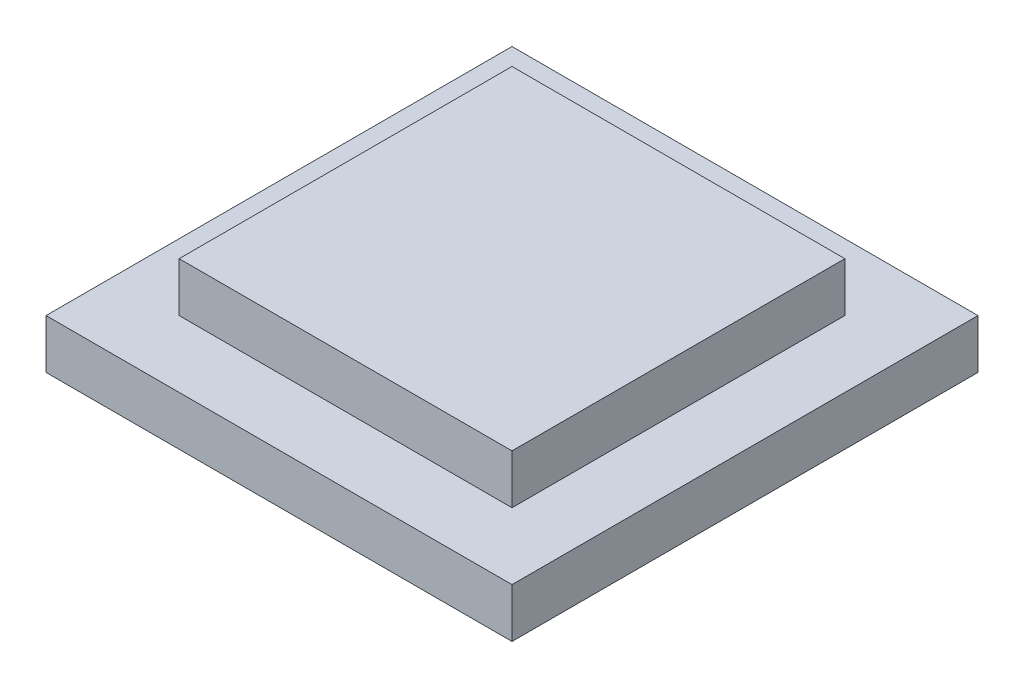
ISO-10303-21;
HEADER;
FILE_DESCRIPTION(('STEP AP214'),'2;1');
FILE_NAME('part.step','',(''),(''),'','','');
FILE_SCHEMA(('AUTOMOTIVE_DESIGN { 1 0 10303 214 1 1 1 1 }'));
ENDSEC;
DATA;
#1=APPLICATION_CONTEXT('core data for automotive mechanical design processes');
#2=APPLICATION_PROTOCOL_DEFINITION('international standard','automotive_design',2000,#1);
#3=PRODUCT_CONTEXT('',#1,'mechanical');
#4=PRODUCT('Part','Part','',(#3));
#5=PRODUCT_RELATED_PRODUCT_CATEGORY('part','',(#4));
#6=PRODUCT_DEFINITION_FORMATION('','',#4);
#7=PRODUCT_DEFINITION_CONTEXT('part definition',#1,'design');
#8=PRODUCT_DEFINITION('design','',#6,#7);
#9=PRODUCT_DEFINITION_SHAPE('','',#8);
#10=(LENGTH_UNIT() NAMED_UNIT(*) SI_UNIT(.MILLI.,.METRE.));
#11=(NAMED_UNIT(*) PLANE_ANGLE_UNIT() SI_UNIT($,.RADIAN.));
#12=(NAMED_UNIT(*) SI_UNIT($,.STERADIAN.) SOLID_ANGLE_UNIT());
#13=UNCERTAINTY_MEASURE_WITH_UNIT(LENGTH_MEASURE(1.E-05),#10,'distance_accuracy_value','');
#14=(GEOMETRIC_REPRESENTATION_CONTEXT(3) GLOBAL_UNCERTAINTY_ASSIGNED_CONTEXT((#13)) GLOBAL_UNIT_ASSIGNED_CONTEXT((#10,
#11,#12)) REPRESENTATION_CONTEXT('',''));
#15=CARTESIAN_POINT('',(0.,0.,0.));
#16=DIRECTION('',(0.,0.,1.));
#17=DIRECTION('',(1.,0.,0.));
#18=AXIS2_PLACEMENT_3D('',#15,#16,#17);
#19=CARTESIAN_POINT('',(0.,3.7,0.));
#20=DIRECTION('',(0.,-1.,0.));
#21=DIRECTION('',(0.,0.,-1.));
#22=AXIS2_PLACEMENT_3D('',#19,#20,#21);
#23=PLANE('',#22);
#24=DIRECTION('',(0.,0.,-1.));
#25=VECTOR('',#24,1.);
#26=CARTESIAN_POINT('',(17.5,3.7,17.5));
#27=LINE('',#26,#25);
#28=CARTESIAN_POINT('',(17.5,3.7,17.5));
#29=VERTEX_POINT('',#28);
#30=CARTESIAN_POINT('',(17.5,3.7,-17.5));
#31=VERTEX_POINT('',#30);
#32=EDGE_CURVE('E139',#29,#31,#27,.T.);
#33=ORIENTED_EDGE('',*,*,#32,.T.);
#34=DIRECTION('',(-1.,0.,0.));
#35=VECTOR('',#34,1.);
#36=CARTESIAN_POINT('',(-17.5,3.7,-17.5));
#37=LINE('',#36,#35);
#38=CARTESIAN_POINT('',(-17.5,3.7,-17.5));
#39=VERTEX_POINT('',#38);
#40=EDGE_CURVE('E143',#31,#39,#37,.T.);
#41=ORIENTED_EDGE('',*,*,#40,.T.);
#42=DIRECTION('',(0.,0.,1.));
#43=VECTOR('',#42,1.);
#44=CARTESIAN_POINT('',(-17.5,3.7,17.5));
#45=LINE('',#44,#43);
#46=CARTESIAN_POINT('',(-17.5,3.7,17.5));
#47=VERTEX_POINT('',#46);
#48=EDGE_CURVE('E147',#39,#47,#45,.T.);
#49=ORIENTED_EDGE('',*,*,#48,.T.);
#50=DIRECTION('',(1.,0.,0.));
#51=VECTOR('',#50,1.);
#52=CARTESIAN_POINT('',(-17.5,3.7,17.5));
#53=LINE('',#52,#51);
#54=EDGE_CURVE('E150',#47,#29,#53,.T.);
#55=ORIENTED_EDGE('',*,*,#54,.T.);
#56=EDGE_LOOP('',(#33,#41,#49,#55));
#57=FACE_BOUND('',#56,.T.);
#58=DIRECTION('',(0.,0.,-1.));
#59=VECTOR('',#58,1.);
#60=CARTESIAN_POINT('',(12.5,3.7,12.5));
#61=LINE('',#60,#59);
#62=CARTESIAN_POINT('',(12.5,3.7,12.5));
#63=VERTEX_POINT('',#62);
#64=CARTESIAN_POINT('',(12.5,3.7,-12.5));
#65=VERTEX_POINT('',#64);
#66=EDGE_CURVE('E55',#63,#65,#61,.T.);
#67=ORIENTED_EDGE('',*,*,#66,.F.);
#68=DIRECTION('',(1.,0.,0.));
#69=VECTOR('',#68,1.);
#70=CARTESIAN_POINT('',(-12.5,3.7,12.5));
#71=LINE('',#70,#69);
#72=CARTESIAN_POINT('',(-12.5,3.7,12.5));
#73=VERTEX_POINT('',#72);
#74=EDGE_CURVE('E59',#73,#63,#71,.T.);
#75=ORIENTED_EDGE('',*,*,#74,.F.);
#76=DIRECTION('',(0.,0.,1.));
#77=VECTOR('',#76,1.);
#78=CARTESIAN_POINT('',(-12.5,3.7,12.5));
#79=LINE('',#78,#77);
#80=CARTESIAN_POINT('',(-12.5,3.7,-12.5));
#81=VERTEX_POINT('',#80);
#82=EDGE_CURVE('E283',#81,#73,#79,.T.);
#83=ORIENTED_EDGE('',*,*,#82,.F.);
#84=DIRECTION('',(-1.,0.,0.));
#85=VECTOR('',#84,1.);
#86=CARTESIAN_POINT('',(-12.5,3.7,-12.5));
#87=LINE('',#86,#85);
#88=EDGE_CURVE('E293',#65,#81,#87,.T.);
#89=ORIENTED_EDGE('',*,*,#88,.F.);
#90=EDGE_LOOP('',(#67,#75,#83,#89));
#91=FACE_BOUND('',#90,.T.);
#92=ADVANCED_FACE('F39',(#57,#91),#23,.F.);
#93=CARTESIAN_POINT('',(17.5,3.7,17.5));
#94=DIRECTION('',(-1.,0.,0.));
#95=DIRECTION('',(0.,0.,1.));
#96=AXIS2_PLACEMENT_3D('',#93,#94,#95);
#97=PLANE('',#96);
#98=DIRECTION('',(0.,0.,-1.));
#99=VECTOR('',#98,1.);
#100=CARTESIAN_POINT('',(17.5,0.,17.5));
#101=LINE('',#100,#99);
#102=CARTESIAN_POINT('',(17.5,0.,17.5));
#103=VERTEX_POINT('',#102);
#104=CARTESIAN_POINT('',(17.5,0.,-17.5));
#105=VERTEX_POINT('',#104);
#106=EDGE_CURVE('E128',#103,#105,#101,.T.);
#107=ORIENTED_EDGE('',*,*,#106,.T.);
#108=DIRECTION('',(0.,-1.,0.));
#109=VECTOR('',#108,1.);
#110=CARTESIAN_POINT('',(17.5,3.7,-17.5));
#111=LINE('',#110,#109);
#112=EDGE_CURVE('E11',#31,#105,#111,.T.);
#113=ORIENTED_EDGE('',*,*,#112,.F.);
#114=ORIENTED_EDGE('',*,*,#32,.F.);
#115=DIRECTION('',(0.,-1.,0.));
#116=VECTOR('',#115,1.);
#117=CARTESIAN_POINT('',(17.5,3.7,17.5));
#118=LINE('',#117,#116);
#119=EDGE_CURVE('E152',#29,#103,#118,.T.);
#120=ORIENTED_EDGE('',*,*,#119,.T.);
#121=EDGE_LOOP('',(#107,#113,#114,#120));
#122=FACE_BOUND('',#121,.T.);
#123=ADVANCED_FACE('F41',(#122),#97,.F.);
#124=CARTESIAN_POINT('',(-17.5,3.7,-17.5));
#125=DIRECTION('',(0.,0.,1.));
#126=DIRECTION('',(1.,0.,0.));
#127=AXIS2_PLACEMENT_3D('',#124,#125,#126);
#128=PLANE('',#127);
#129=DIRECTION('',(-1.,0.,0.));
#130=VECTOR('',#129,1.);
#131=CARTESIAN_POINT('',(-17.5,0.,-17.5));
#132=LINE('',#131,#130);
#133=CARTESIAN_POINT('',(-17.5,0.,-17.5));
#134=VERTEX_POINT('',#133);
#135=EDGE_CURVE('E133',#105,#134,#132,.T.);
#136=ORIENTED_EDGE('',*,*,#135,.T.);
#137=DIRECTION('',(0.,-1.,0.));
#138=VECTOR('',#137,1.);
#139=CARTESIAN_POINT('',(-17.5,3.7,-17.5));
#140=LINE('',#139,#138);
#141=EDGE_CURVE('E48',#39,#134,#140,.T.);
#142=ORIENTED_EDGE('',*,*,#141,.F.);
#143=ORIENTED_EDGE('',*,*,#40,.F.);
#144=ORIENTED_EDGE('',*,*,#112,.T.);
#145=EDGE_LOOP('',(#136,#142,#143,#144));
#146=FACE_BOUND('',#145,.T.);
#147=ADVANCED_FACE('F188',(#146),#128,.F.);
#148=CARTESIAN_POINT('',(-17.5,3.7,17.5));
#149=DIRECTION('',(1.,0.,0.));
#150=DIRECTION('',(0.,0.,-1.));
#151=AXIS2_PLACEMENT_3D('',#148,#149,#150);
#152=PLANE('',#151);
#153=DIRECTION('',(0.,0.,1.));
#154=VECTOR('',#153,1.);
#155=CARTESIAN_POINT('',(-17.5,0.,17.5));
#156=LINE('',#155,#154);
#157=CARTESIAN_POINT('',(-17.5,0.,17.5));
#158=VERTEX_POINT('',#157);
#159=EDGE_CURVE('E156',#134,#158,#156,.T.);
#160=ORIENTED_EDGE('',*,*,#159,.T.);
#161=DIRECTION('',(0.,-1.,0.));
#162=VECTOR('',#161,1.);
#163=CARTESIAN_POINT('',(-17.5,3.7,17.5));
#164=LINE('',#163,#162);
#165=EDGE_CURVE('E164',#47,#158,#164,.T.);
#166=ORIENTED_EDGE('',*,*,#165,.F.);
#167=ORIENTED_EDGE('',*,*,#48,.F.);
#168=ORIENTED_EDGE('',*,*,#141,.T.);
#169=EDGE_LOOP('',(#160,#166,#167,#168));
#170=FACE_BOUND('',#169,.T.);
#171=ADVANCED_FACE('F173',(#170),#152,.F.);
#172=CARTESIAN_POINT('',(-17.5,3.7,17.5));
#173=DIRECTION('',(0.,0.,-1.));
#174=DIRECTION('',(-1.,0.,0.));
#175=AXIS2_PLACEMENT_3D('',#172,#173,#174);
#176=PLANE('',#175);
#177=DIRECTION('',(1.,0.,0.));
#178=VECTOR('',#177,1.);
#179=CARTESIAN_POINT('',(-17.5,0.,17.5));
#180=LINE('',#179,#178);
#181=EDGE_CURVE('E144',#158,#103,#180,.T.);
#182=ORIENTED_EDGE('',*,*,#181,.T.);
#183=ORIENTED_EDGE('',*,*,#119,.F.);
#184=ORIENTED_EDGE('',*,*,#54,.F.);
#185=ORIENTED_EDGE('',*,*,#165,.T.);
#186=EDGE_LOOP('',(#182,#183,#184,#185));
#187=FACE_BOUND('',#186,.T.);
#188=ADVANCED_FACE('F182',(#187),#176,.F.);
#189=CARTESIAN_POINT('',(0.,0.,0.));
#190=DIRECTION('',(0.,-1.,0.));
#191=DIRECTION('',(0.,0.,-1.));
#192=AXIS2_PLACEMENT_3D('',#189,#190,#191);
#193=PLANE('',#192);
#194=ORIENTED_EDGE('',*,*,#106,.F.);
#195=ORIENTED_EDGE('',*,*,#181,.F.);
#196=ORIENTED_EDGE('',*,*,#159,.F.);
#197=ORIENTED_EDGE('',*,*,#135,.F.);
#198=EDGE_LOOP('',(#194,#195,#196,#197));
#199=FACE_BOUND('',#198,.T.);
#200=ADVANCED_FACE('F179',(#199),#193,.T.);
#201=CARTESIAN_POINT('',(12.5,7.4,12.5));
#202=DIRECTION('',(-1.,0.,0.));
#203=DIRECTION('',(0.,0.,1.));
#204=AXIS2_PLACEMENT_3D('',#201,#202,#203);
#205=PLANE('',#204);
#206=ORIENTED_EDGE('',*,*,#66,.T.);
#207=DIRECTION('',(0.,-1.,0.));
#208=VECTOR('',#207,1.);
#209=CARTESIAN_POINT('',(12.5,7.4,-12.5));
#210=LINE('',#209,#208);
#211=CARTESIAN_POINT('',(12.5,7.4,-12.5));
#212=VERTEX_POINT('',#211);
#213=EDGE_CURVE('E108',#212,#65,#210,.T.);
#214=ORIENTED_EDGE('',*,*,#213,.F.);
#215=DIRECTION('',(0.,0.,-1.));
#216=VECTOR('',#215,1.);
#217=CARTESIAN_POINT('',(12.5,7.4,12.5));
#218=LINE('',#217,#216);
#219=CARTESIAN_POINT('',(12.5,7.4,12.5));
#220=VERTEX_POINT('',#219);
#221=EDGE_CURVE('E115',#220,#212,#218,.T.);
#222=ORIENTED_EDGE('',*,*,#221,.F.);
#223=DIRECTION('',(0.,-1.,0.));
#224=VECTOR('',#223,1.);
#225=CARTESIAN_POINT('',(12.5,7.4,12.5));
#226=LINE('',#225,#224);
#227=EDGE_CURVE('E280',#220,#63,#226,.T.);
#228=ORIENTED_EDGE('',*,*,#227,.T.);
#229=EDGE_LOOP('',(#206,#214,#222,#228));
#230=FACE_BOUND('',#229,.T.);
#231=ADVANCED_FACE('F126',(#230),#205,.F.);
#232=CARTESIAN_POINT('',(-12.5,7.4,-12.5));
#233=DIRECTION('',(0.,0.,1.));
#234=DIRECTION('',(1.,0.,0.));
#235=AXIS2_PLACEMENT_3D('',#232,#233,#234);
#236=PLANE('',#235);
#237=ORIENTED_EDGE('',*,*,#88,.T.);
#238=DIRECTION('',(0.,-1.,0.));
#239=VECTOR('',#238,1.);
#240=CARTESIAN_POINT('',(-12.5,7.4,-12.5));
#241=LINE('',#240,#239);
#242=CARTESIAN_POINT('',(-12.5,7.4,-12.5));
#243=VERTEX_POINT('',#242);
#244=EDGE_CURVE('E110',#243,#81,#241,.T.);
#245=ORIENTED_EDGE('',*,*,#244,.F.);
#246=DIRECTION('',(-1.,0.,0.));
#247=VECTOR('',#246,1.);
#248=CARTESIAN_POINT('',(-12.5,7.4,-12.5));
#249=LINE('',#248,#247);
#250=EDGE_CURVE('E103',#212,#243,#249,.T.);
#251=ORIENTED_EDGE('',*,*,#250,.F.);
#252=ORIENTED_EDGE('',*,*,#213,.T.);
#253=EDGE_LOOP('',(#237,#245,#251,#252));
#254=FACE_BOUND('',#253,.T.);
#255=ADVANCED_FACE('F106',(#254),#236,.F.);
#256=CARTESIAN_POINT('',(-12.5,7.4,12.5));
#257=DIRECTION('',(1.,0.,0.));
#258=DIRECTION('',(0.,0.,-1.));
#259=AXIS2_PLACEMENT_3D('',#256,#257,#258);
#260=PLANE('',#259);
#261=ORIENTED_EDGE('',*,*,#82,.T.);
#262=DIRECTION('',(0.,-1.,0.));
#263=VECTOR('',#262,1.);
#264=CARTESIAN_POINT('',(-12.5,7.4,12.5));
#265=LINE('',#264,#263);
#266=CARTESIAN_POINT('',(-12.5,7.4,12.5));
#267=VERTEX_POINT('',#266);
#268=EDGE_CURVE('E135',#267,#73,#265,.T.);
#269=ORIENTED_EDGE('',*,*,#268,.F.);
#270=DIRECTION('',(0.,0.,1.));
#271=VECTOR('',#270,1.);
#272=CARTESIAN_POINT('',(-12.5,7.4,12.5));
#273=LINE('',#272,#271);
#274=EDGE_CURVE('E114',#243,#267,#273,.T.);
#275=ORIENTED_EDGE('',*,*,#274,.F.);
#276=ORIENTED_EDGE('',*,*,#244,.T.);
#277=EDGE_LOOP('',(#261,#269,#275,#276));
#278=FACE_BOUND('',#277,.T.);
#279=ADVANCED_FACE('F224',(#278),#260,.F.);
#280=CARTESIAN_POINT('',(-12.5,7.4,12.5));
#281=DIRECTION('',(0.,0.,-1.));
#282=DIRECTION('',(-1.,0.,0.));
#283=AXIS2_PLACEMENT_3D('',#280,#281,#282);
#284=PLANE('',#283);
#285=ORIENTED_EDGE('',*,*,#74,.T.);
#286=ORIENTED_EDGE('',*,*,#227,.F.);
#287=DIRECTION('',(1.,0.,0.));
#288=VECTOR('',#287,1.);
#289=CARTESIAN_POINT('',(-12.5,7.4,12.5));
#290=LINE('',#289,#288);
#291=EDGE_CURVE('E120',#267,#220,#290,.T.);
#292=ORIENTED_EDGE('',*,*,#291,.F.);
#293=ORIENTED_EDGE('',*,*,#268,.T.);
#294=EDGE_LOOP('',(#285,#286,#292,#293));
#295=FACE_BOUND('',#294,.T.);
#296=ADVANCED_FACE('F230',(#295),#284,.F.);
#297=CARTESIAN_POINT('',(0.,7.4,0.));
#298=DIRECTION('',(0.,-1.,0.));
#299=DIRECTION('',(0.,0.,-1.));
#300=AXIS2_PLACEMENT_3D('',#297,#298,#299);
#301=PLANE('',#300);
#302=ORIENTED_EDGE('',*,*,#221,.T.);
#303=ORIENTED_EDGE('',*,*,#250,.T.);
#304=ORIENTED_EDGE('',*,*,#274,.T.);
#305=ORIENTED_EDGE('',*,*,#291,.T.);
#306=EDGE_LOOP('',(#302,#303,#304,#305));
#307=FACE_BOUND('',#306,.T.);
#308=ADVANCED_FACE('F118',(#307),#301,.F.);
#309=CLOSED_SHELL('',(#92,#123,#147,#171,#188,#200,#231,#255,#279,#296,#308));
#310=MANIFOLD_SOLID_BREP('B2',#309);
#311=ADVANCED_BREP_SHAPE_REPRESENTATION('',(#18,#310),#14);
#312=SHAPE_DEFINITION_REPRESENTATION(#9,#311);
ENDSEC;
END-ISO-10303-21;
